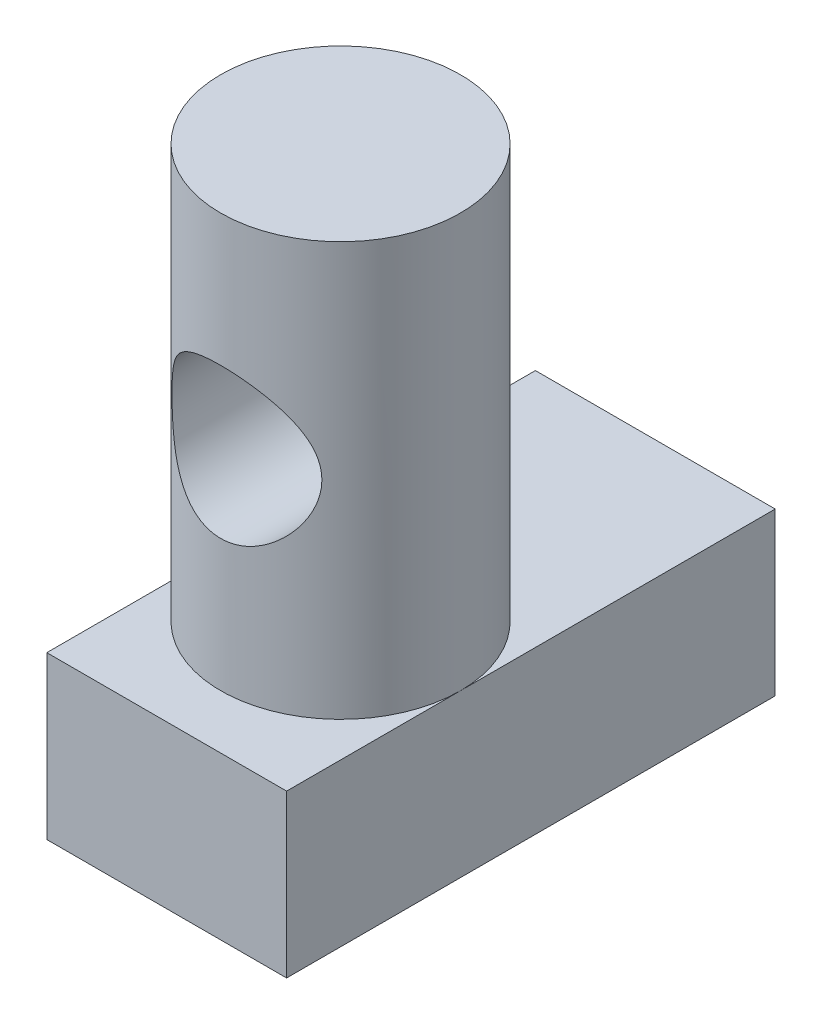
ISO-10303-21;
HEADER;
FILE_DESCRIPTION(('STEP AP214'),'2;1');
FILE_NAME('part.step','',(''),(''),'','','');
FILE_SCHEMA(('AUTOMOTIVE_DESIGN { 1 0 10303 214 1 1 1 1 }'));
ENDSEC;
DATA;
#1=APPLICATION_CONTEXT('core data for automotive mechanical design processes');
#2=APPLICATION_PROTOCOL_DEFINITION('international standard','automotive_design',2000,#1);
#3=PRODUCT_CONTEXT('',#1,'mechanical');
#4=PRODUCT('Part','Part','',(#3));
#5=PRODUCT_RELATED_PRODUCT_CATEGORY('part','',(#4));
#6=PRODUCT_DEFINITION_FORMATION('','',#4);
#7=PRODUCT_DEFINITION_CONTEXT('part definition',#1,'design');
#8=PRODUCT_DEFINITION('design','',#6,#7);
#9=PRODUCT_DEFINITION_SHAPE('','',#8);
#10=(LENGTH_UNIT() NAMED_UNIT(*) SI_UNIT(.MILLI.,.METRE.));
#11=(NAMED_UNIT(*) PLANE_ANGLE_UNIT() SI_UNIT($,.RADIAN.));
#12=(NAMED_UNIT(*) SI_UNIT($,.STERADIAN.) SOLID_ANGLE_UNIT());
#13=UNCERTAINTY_MEASURE_WITH_UNIT(LENGTH_MEASURE(1.E-05),#10,'distance_accuracy_value','');
#14=(GEOMETRIC_REPRESENTATION_CONTEXT(3) GLOBAL_UNCERTAINTY_ASSIGNED_CONTEXT((#13)) GLOBAL_UNIT_ASSIGNED_CONTEXT((#10,
#11,#12)) REPRESENTATION_CONTEXT('',''));
#15=CARTESIAN_POINT('',(0.,0.,0.));
#16=DIRECTION('',(0.,0.,1.));
#17=DIRECTION('',(1.,0.,0.));
#18=AXIS2_PLACEMENT_3D('',#15,#16,#17);
#19=CARTESIAN_POINT('',(0.,0.,0.));
#20=DIRECTION('',(0.,-1.,0.));
#21=DIRECTION('',(0.,0.,-1.));
#22=AXIS2_PLACEMENT_3D('',#19,#20,#21);
#23=PLANE('',#22);
#24=CARTESIAN_POINT('',(0.,0.,1.17500000000001));
#25=DIRECTION('',(0.,1.,0.));
#26=DIRECTION('',(0.,0.,1.));
#27=AXIS2_PLACEMENT_3D('',#24,#25,#26);
#28=CIRCLE('',#27,2.);
#29=CARTESIAN_POINT('',(2.,0.,1.17500000000001));
#30=VERTEX_POINT('',#29);
#31=CARTESIAN_POINT('',(-2.,0.,1.17500000000001));
#32=VERTEX_POINT('',#31);
#33=EDGE_CURVE('E49',#30,#32,#28,.T.);
#34=ORIENTED_EDGE('',*,*,#33,.F.);
#35=DIRECTION('',(0.,0.,-1.));
#36=VECTOR('',#35,1.);
#37=CARTESIAN_POINT('',(2.,0.,-4.07500000000001));
#38=LINE('',#37,#36);
#39=CARTESIAN_POINT('',(2.,0.,-4.07500000000001));
#40=VERTEX_POINT('',#39);
#41=EDGE_CURVE('E100',#30,#40,#38,.T.);
#42=ORIENTED_EDGE('',*,*,#41,.T.);
#43=DIRECTION('',(-1.,0.,0.));
#44=VECTOR('',#43,1.);
#45=CARTESIAN_POINT('',(-2.,0.,-4.075));
#46=LINE('',#45,#44);
#47=CARTESIAN_POINT('',(-2.,0.,-4.075));
#48=VERTEX_POINT('',#47);
#49=EDGE_CURVE('E99',#40,#48,#46,.T.);
#50=ORIENTED_EDGE('',*,*,#49,.T.);
#51=DIRECTION('',(0.,0.,1.));
#52=VECTOR('',#51,1.);
#53=CARTESIAN_POINT('',(-2.,0.,4.07500000000001));
#54=LINE('',#53,#52);
#55=EDGE_CURVE('E111',#48,#32,#54,.T.);
#56=ORIENTED_EDGE('',*,*,#55,.T.);
#57=EDGE_LOOP('',(#34,#42,#50,#56));
#58=FACE_BOUND('',#57,.T.);
#59=ADVANCED_FACE('F34',(#58),#23,.F.);
#60=CARTESIAN_POINT('',(-2.,-2.7,4.07500000000001));
#61=DIRECTION('',(-1.,0.,0.));
#62=DIRECTION('',(0.,0.,1.));
#63=AXIS2_PLACEMENT_3D('',#60,#61,#62);
#64=PLANE('',#63);
#65=ORIENTED_EDGE('',*,*,#55,.F.);
#66=DIRECTION('',(0.,1.,0.));
#67=VECTOR('',#66,1.);
#68=CARTESIAN_POINT('',(-2.,-2.7,-4.075));
#69=LINE('',#68,#67);
#70=CARTESIAN_POINT('',(-2.,-2.7,-4.075));
#71=VERTEX_POINT('',#70);
#72=EDGE_CURVE('E47',#71,#48,#69,.T.);
#73=ORIENTED_EDGE('',*,*,#72,.F.);
#74=DIRECTION('',(0.,0.,1.));
#75=VECTOR('',#74,1.);
#76=CARTESIAN_POINT('',(-2.,-2.7,4.07500000000001));
#77=LINE('',#76,#75);
#78=CARTESIAN_POINT('',(-2.,-2.7,4.07500000000001));
#79=VERTEX_POINT('',#78);
#80=EDGE_CURVE('E153',#71,#79,#77,.T.);
#81=ORIENTED_EDGE('',*,*,#80,.T.);
#82=DIRECTION('',(0.,1.,0.));
#83=VECTOR('',#82,1.);
#84=CARTESIAN_POINT('',(-2.,-2.7,4.07500000000001));
#85=LINE('',#84,#83);
#86=CARTESIAN_POINT('',(-2.,0.,4.07500000000001));
#87=VERTEX_POINT('',#86);
#88=EDGE_CURVE('E88',#79,#87,#85,.T.);
#89=ORIENTED_EDGE('',*,*,#88,.T.);
#90=EDGE_CURVE('E148',#32,#87,#54,.T.);
#91=ORIENTED_EDGE('',*,*,#90,.F.);
#92=EDGE_LOOP('',(#65,#73,#81,#89,#91));
#93=FACE_BOUND('',#92,.T.);
#94=ADVANCED_FACE('F36',(#93),#64,.T.);
#95=CARTESIAN_POINT('',(-2.,-2.7,-4.075));
#96=DIRECTION('',(0.,0.,-1.));
#97=DIRECTION('',(-1.,0.,0.));
#98=AXIS2_PLACEMENT_3D('',#95,#96,#97);
#99=PLANE('',#98);
#100=ORIENTED_EDGE('',*,*,#49,.F.);
#101=DIRECTION('',(0.,1.,0.));
#102=VECTOR('',#101,1.);
#103=CARTESIAN_POINT('',(2.,-2.7,-4.07500000000001));
#104=LINE('',#103,#102);
#105=CARTESIAN_POINT('',(2.,-2.7,-4.07500000000001));
#106=VERTEX_POINT('',#105);
#107=EDGE_CURVE('E106',#106,#40,#104,.T.);
#108=ORIENTED_EDGE('',*,*,#107,.F.);
#109=DIRECTION('',(-1.,0.,0.));
#110=VECTOR('',#109,1.);
#111=CARTESIAN_POINT('',(-2.,-2.7,-4.075));
#112=LINE('',#111,#110);
#113=EDGE_CURVE('E157',#106,#71,#112,.T.);
#114=ORIENTED_EDGE('',*,*,#113,.T.);
#115=ORIENTED_EDGE('',*,*,#72,.T.);
#116=EDGE_LOOP('',(#100,#108,#114,#115));
#117=FACE_BOUND('',#116,.T.);
#118=ADVANCED_FACE('F135',(#117),#99,.T.);
#119=CARTESIAN_POINT('',(2.,-2.7,-4.07500000000001));
#120=DIRECTION('',(1.,0.,0.));
#121=DIRECTION('',(0.,0.,-1.));
#122=AXIS2_PLACEMENT_3D('',#119,#120,#121);
#123=PLANE('',#122);
#124=CARTESIAN_POINT('',(2.,0.,4.07500000000001));
#125=VERTEX_POINT('',#124);
#126=EDGE_CURVE('E94',#125,#30,#38,.T.);
#127=ORIENTED_EDGE('',*,*,#126,.F.);
#128=DIRECTION('',(0.,1.,0.));
#129=VECTOR('',#128,1.);
#130=CARTESIAN_POINT('',(2.,-2.7,4.07500000000001));
#131=LINE('',#130,#129);
#132=CARTESIAN_POINT('',(2.,-2.7,4.07500000000001));
#133=VERTEX_POINT('',#132);
#134=EDGE_CURVE('E146',#133,#125,#131,.T.);
#135=ORIENTED_EDGE('',*,*,#134,.F.);
#136=DIRECTION('',(0.,0.,-1.));
#137=VECTOR('',#136,1.);
#138=CARTESIAN_POINT('',(2.,-2.7,-4.07500000000001));
#139=LINE('',#138,#137);
#140=EDGE_CURVE('E179',#133,#106,#139,.T.);
#141=ORIENTED_EDGE('',*,*,#140,.T.);
#142=ORIENTED_EDGE('',*,*,#107,.T.);
#143=ORIENTED_EDGE('',*,*,#41,.F.);
#144=EDGE_LOOP('',(#127,#135,#141,#142,#143));
#145=FACE_BOUND('',#144,.T.);
#146=ADVANCED_FACE('F104',(#145),#123,.T.);
#147=CARTESIAN_POINT('',(2.,-2.7,4.07500000000001));
#148=DIRECTION('',(0.,0.,1.));
#149=DIRECTION('',(1.,0.,0.));
#150=AXIS2_PLACEMENT_3D('',#147,#148,#149);
#151=PLANE('',#150);
#152=DIRECTION('',(1.,0.,0.));
#153=VECTOR('',#152,1.);
#154=CARTESIAN_POINT('',(2.,0.,4.07500000000001));
#155=LINE('',#154,#153);
#156=EDGE_CURVE('E97',#87,#125,#155,.T.);
#157=ORIENTED_EDGE('',*,*,#156,.F.);
#158=ORIENTED_EDGE('',*,*,#88,.F.);
#159=DIRECTION('',(1.,0.,0.));
#160=VECTOR('',#159,1.);
#161=CARTESIAN_POINT('',(2.,-2.7,4.07500000000001));
#162=LINE('',#161,#160);
#163=EDGE_CURVE('E177',#79,#133,#162,.T.);
#164=ORIENTED_EDGE('',*,*,#163,.T.);
#165=ORIENTED_EDGE('',*,*,#134,.T.);
#166=EDGE_LOOP('',(#157,#158,#164,#165));
#167=FACE_BOUND('',#166,.T.);
#168=ADVANCED_FACE('F140',(#167),#151,.T.);
#169=CARTESIAN_POINT('',(0.,-2.7,0.));
#170=DIRECTION('',(0.,-1.,0.));
#171=DIRECTION('',(0.,0.,-1.));
#172=AXIS2_PLACEMENT_3D('',#169,#170,#171);
#173=PLANE('',#172);
#174=ORIENTED_EDGE('',*,*,#80,.F.);
#175=ORIENTED_EDGE('',*,*,#113,.F.);
#176=ORIENTED_EDGE('',*,*,#140,.F.);
#177=ORIENTED_EDGE('',*,*,#163,.F.);
#178=EDGE_LOOP('',(#174,#175,#176,#177));
#179=FACE_BOUND('',#178,.T.);
#180=ADVANCED_FACE('F125',(#179),#173,.T.);
#181=EDGE_CURVE('E11',#32,#30,#28,.T.);
#182=ORIENTED_EDGE('',*,*,#181,.F.);
#183=ORIENTED_EDGE('',*,*,#90,.T.);
#184=ORIENTED_EDGE('',*,*,#156,.T.);
#185=ORIENTED_EDGE('',*,*,#126,.T.);
#186=EDGE_LOOP('',(#182,#183,#184,#185));
#187=FACE_BOUND('',#186,.T.);
#188=ADVANCED_FACE('F96',(#187),#23,.F.);
#189=CARTESIAN_POINT('',(0.,6.9,1.17500000000001));
#190=DIRECTION('',(0.,-1.,0.));
#191=DIRECTION('',(0.,0.,-1.));
#192=AXIS2_PLACEMENT_3D('',#189,#190,#191);
#193=CYLINDRICAL_SURFACE('',#192,2.);
#194=CARTESIAN_POINT('',(0.,4.7,-0.824999999999993));
#195=CARTESIAN_POINT('',(-0.0635104730002022,4.69999565000122,-0.82499595305312));
#196=CARTESIAN_POINT('',(-0.127096441053757,4.69512698818219,-0.821943233110001));
#197=CARTESIAN_POINT('',(-0.252318262265282,4.6759141965705,-0.810021677241014));
#198=CARTESIAN_POINT('',(-0.313950163299072,4.66155200607452,-0.801141755748952));
#199=CARTESIAN_POINT('',(-0.433205558136782,4.62418863683795,-0.778458529821337));
#200=CARTESIAN_POINT('',(-0.490847243665016,4.60123021215912,-0.764679607786621));
#201=CARTESIAN_POINT('',(-0.60126036886836,4.54761414920325,-0.733345984860724));
#202=CARTESIAN_POINT('',(-0.654032347276152,4.51695736399081,-0.715791702352704));
#203=CARTESIAN_POINT('',(-0.757974192167972,4.44611342681503,-0.676701529022724));
#204=CARTESIAN_POINT('',(-0.808679560769976,4.40536070002455,-0.654959622246163));
#205=CARTESIAN_POINT('',(-0.902986375146758,4.31678082549345,-0.610313499136311));
#206=CARTESIAN_POINT('',(-0.946578107215733,4.26894417174206,-0.587407748585521));
#207=CARTESIAN_POINT('',(-1.03142873237132,4.15996610579548,-0.53930418655198));
#208=CARTESIAN_POINT('',(-1.07157206029151,4.09790021339272,-0.514216109934116));
#209=CARTESIAN_POINT('',(-1.14073966020039,3.96643518455281,-0.468301981287304));
#210=CARTESIAN_POINT('',(-1.16978270899534,3.89704868742392,-0.447468759962378));
#211=CARTESIAN_POINT('',(-1.20933400585981,3.77118947622128,-0.418095756273635));
#212=CARTESIAN_POINT('',(-1.22269552371393,3.71603318146118,-0.407769059900731));
#213=CARTESIAN_POINT('',(-1.2418184358548,3.6036940743892,-0.392813573258048));
#214=CARTESIAN_POINT('',(-1.24759056342088,3.54651424172551,-0.388176736736916));
#215=CARTESIAN_POINT('',(-1.2511891824572,3.43158698324888,-0.385298857828265));
#216=CARTESIAN_POINT('',(-1.24899483727851,3.3738384635376,-0.387074587717179));
#217=CARTESIAN_POINT('',(-1.23676317046804,3.25968989681104,-0.396774023839191));
#218=CARTESIAN_POINT('',(-1.22671956265043,3.20329096796092,-0.404702657671095));
#219=CARTESIAN_POINT('',(-1.19968103371474,3.09456154734252,-0.4253257312178));
#220=CARTESIAN_POINT('',(-1.18285016736897,3.04216754431573,-0.437907151048131));
#221=CARTESIAN_POINT('',(-1.14290189820937,2.94083881759458,-0.46645566443405));
#222=CARTESIAN_POINT('',(-1.11978227193696,2.89190532512551,-0.482423955013528));
#223=CARTESIAN_POINT('',(-1.06294892954949,2.78916672616726,-0.51954815993019));
#224=CARTESIAN_POINT('',(-1.0280629660117,2.73615918987961,-0.541115915759584));
#225=CARTESIAN_POINT('',(-0.950881463002101,2.63616972099952,-0.585057117912427));
#226=CARTESIAN_POINT('',(-0.908578308011437,2.58919406829348,-0.607431373359749));
#227=CARTESIAN_POINT('',(-0.809519713023332,2.49469825062961,-0.654798949168561));
#228=CARTESIAN_POINT('',(-0.751531353595333,2.44836702574117,-0.679615316765924));
#229=CARTESIAN_POINT('',(-0.627148099593569,2.36614910411275,-0.725280550624441));
#230=CARTESIAN_POINT('',(-0.560756523881999,2.33025830227107,-0.746130975147631));
#231=CARTESIAN_POINT('',(-0.424883562934748,2.27223631161858,-0.780533729613156));
#232=CARTESIAN_POINT('',(-0.355763457732371,2.24946596001882,-0.794419765915734));
#233=CARTESIAN_POINT('',(-0.213612154574976,2.21623507201719,-0.814849293100475));
#234=CARTESIAN_POINT('',(-0.140586648341304,2.205757105778,-0.821403179900693));
#235=CARTESIAN_POINT('',(-0.00451561874058841,2.1984341499388,-0.825978405400905));
#236=CARTESIAN_POINT('',(0.058402774163785,2.19979682204614,-0.825121613455099));
#237=CARTESIAN_POINT('',(0.182972117996309,2.21188282842072,-0.817589014943261));
#238=CARTESIAN_POINT('',(0.244623154962733,2.22260552509216,-0.810913604735907));
#239=CARTESIAN_POINT('',(0.36252107065819,2.25223853669196,-0.79274052283069));
#240=CARTESIAN_POINT('',(0.418885009953204,2.27081215679665,-0.781441705268432));
#241=CARTESIAN_POINT('',(0.527638281070988,2.31529638927857,-0.754956841047508));
#242=CARTESIAN_POINT('',(0.580026945470715,2.34120823025515,-0.739770143502657));
#243=CARTESIAN_POINT('',(0.685084056277257,2.40251520599548,-0.704900123559997));
#244=CARTESIAN_POINT('',(0.737246967843405,2.43860356923824,-0.684917648172239));
#245=CARTESIAN_POINT('',(0.835142640217341,2.51779386515281,-0.643069700017161));
#246=CARTESIAN_POINT('',(0.880868151291855,2.56090358925454,-0.621202148263834));
#247=CARTESIAN_POINT('',(0.971474198022883,2.66013503941265,-0.574058697130906));
#248=CARTESIAN_POINT('',(1.01526851939752,2.71723720629478,-0.548748834149564));
#249=CARTESIAN_POINT('',(1.09280351885684,2.83887578494425,-0.500667627481714));
#250=CARTESIAN_POINT('',(1.12655115718694,2.90340700675299,-0.477894533223356));
#251=CARTESIAN_POINT('',(1.17684772011828,3.02469214805688,-0.442335303145913));
#252=CARTESIAN_POINT('',(1.1955189586548,3.08024075073222,-0.42845636193779));
#253=CARTESIAN_POINT('',(1.22500108205245,3.19439314576892,-0.406050306637665));
#254=CARTESIAN_POINT('',(1.23582424983127,3.25299200945146,-0.397514832426048));
#255=CARTESIAN_POINT('',(1.24901383653654,3.37209027688069,-0.387063249887308));
#256=CARTESIAN_POINT('',(1.25133186963293,3.43259858548817,-0.38518501674568));
#257=CARTESIAN_POINT('',(1.24719778716818,3.55313096036604,-0.388490631098465));
#258=CARTESIAN_POINT('',(1.24074275650143,3.61315485900951,-0.393676825955851));
#259=CARTESIAN_POINT('',(1.220382724034,3.72602979505136,-0.409553887713333));
#260=CARTESIAN_POINT('',(1.2071191949977,3.77906930141641,-0.419768080510594));
#261=CARTESIAN_POINT('',(1.17417623469513,3.88213505958591,-0.444175304356895));
#262=CARTESIAN_POINT('',(1.15449412799407,3.9321600445375,-0.458369994237267));
#263=CARTESIAN_POINT('',(1.10602690439618,4.0355967438727,-0.491639028865174));
#264=CARTESIAN_POINT('',(1.0763364445546,4.08845029847655,-0.511122304989962));
#265=CARTESIAN_POINT('',(1.0100001703639,4.18893836724601,-0.551677064118672));
#266=CARTESIAN_POINT('',(0.973348732866944,4.23656861256048,-0.572749822768245));
#267=CARTESIAN_POINT('',(0.885670221416064,4.33501425497784,-0.619019107311807));
#268=CARTESIAN_POINT('',(0.833233674246799,4.38459084544548,-0.644205418087755));
#269=CARTESIAN_POINT('',(0.719822446025209,4.47449482970524,-0.691987290567472));
#270=CARTESIAN_POINT('',(0.658842515138554,4.5148164959274,-0.714581243643939));
#271=CARTESIAN_POINT('',(0.529355399891413,4.5847711301241,-0.754867109765475));
#272=CARTESIAN_POINT('',(0.460835727056575,4.61438600540584,-0.772550713553556));
#273=CARTESIAN_POINT('',(0.318394712729504,4.66107188433175,-0.800815216378417));
#274=CARTESIAN_POINT('',(0.244493501106855,4.67818723486978,-0.811421214286884));
#275=CARTESIAN_POINT('',(0.141418481224667,4.69229920916263,-0.820194721681424));
#276=CARTESIAN_POINT('',(0.113248608862872,4.69518186533397,-0.821991722263006));
#277=CARTESIAN_POINT('',(0.0567241864870911,4.6990332915376,-0.824395302132389));
#278=CARTESIAN_POINT('',(0.0283696251514536,4.70000194310999,-0.825001807739101));
#279=CARTESIAN_POINT('',(0.,4.7,-0.824999999999993));
#280=B_SPLINE_CURVE_WITH_KNOTS('',3,(#194,#195,#196,#197,#198,#199,#200,#201,#202,#203,#204,
#205,#206,#207,#208,#209,#210,#211,#212,#213,#214,#215,#216,#217,#218,#219,#220,#221,#222,#223,
#224,#225,#226,#227,#228,#229,#230,#231,#232,#233,#234,#235,#236,#237,#238,#239,#240,#241,#242,
#243,#244,#245,#246,#247,#248,#249,#250,#251,#252,#253,#254,#255,#256,#257,#258,#259,#260,#261,
#262,#263,#264,#265,#266,#267,#268,#269,#270,#271,#272,#273,#274,#275,#276,#277,#278,#279),
.UNSPECIFIED.,.T.,.F.,(4,2,2,2,2,2,2,2,2,2,2,2,2,2,2,2,2,2,2,2,2,2,2,2,2,2,2,2,2,2,2,2,2,2,2,2,
2,2,2,2,2,2,4),(0.,0.190412301434133,0.381187894128462,0.571026987595136,0.760845054038795,
0.965821870536217,1.17107628325702,1.40412975852973,1.6367872460701,1.80912008879717,
1.98120894707391,2.15374823498778,2.32642584505083,2.49515839460437,2.66395067908033,
2.8642745035436,3.06480522575182,3.29842180699522,3.53194640727861,3.75284174135959,
3.97342347958131,4.16127180597573,4.34910733732281,4.52959504531298,4.71011298928467,
4.90885230990553,5.10781368827686,5.33565708863713,5.56334227196911,5.7432994031372,
5.92297427413352,6.10366974688201,6.28442527563864,6.45063169037741,6.61690747313442,
6.80725523036979,6.9977574115377,7.22600539035112,7.454394245785,7.68316725607078,
7.91112460944408,7.99617501232481,8.08123067890589),.UNSPECIFIED.);
#281=CARTESIAN_POINT('',(0.,4.7,-0.824999999999993));
#282=VERTEX_POINT('',#281);
#283=EDGE_CURVE('E38',#282,#282,#280,.T.);
#284=ORIENTED_EDGE('',*,*,#283,.T.);
#285=EDGE_LOOP('',(#284));
#286=FACE_BOUND('',#285,.T.);
#287=CARTESIAN_POINT('',(1.25,3.45,2.73624949959961));
#288=CARTESIAN_POINT('',(1.24999462210485,3.38787971819707,2.73625800072559));
#289=CARTESIAN_POINT('',(1.24532693849666,3.32566216462974,2.74002642708837));
#290=CARTESIAN_POINT('',(1.22698950832934,3.20332367992062,2.75443717205479));
#291=CARTESIAN_POINT('',(1.21329530430551,3.14320891363476,2.76509816464116));
#292=CARTESIAN_POINT('',(1.17788073911871,3.02721767730116,2.79150085329042));
#293=CARTESIAN_POINT('',(1.15622993332784,2.97130939131819,2.80719837418034));
#294=CARTESIAN_POINT('',(1.10571945561924,2.86399113836185,2.84182950714433));
#295=CARTESIAN_POINT('',(1.07685958706091,2.8125812941435,2.86076320748677));
#296=CARTESIAN_POINT('',(1.00823937928364,2.70813484552302,2.90279611374712));
#297=CARTESIAN_POINT('',(0.967536093692503,2.65580525916741,2.92611338227347));
#298=CARTESIAN_POINT('',(0.87830866449688,2.55811730085503,2.97252820854877));
#299=CARTESIAN_POINT('',(0.829777781297414,2.51276500271608,2.9956255586333));
#300=CARTESIAN_POINT('',(0.719186665258491,2.42489641485188,3.0422945389101));
#301=CARTESIAN_POINT('',(0.656200568910556,2.3833823318957,3.06558722241451));
#302=CARTESIAN_POINT('',(0.522404070837316,2.31187479523684,3.10683231699141));
#303=CARTESIAN_POINT('',(0.451601506478242,2.28186993424875,3.12479001179838));
#304=CARTESIAN_POINT('',(0.311776878362019,2.23751768939294,3.15169841318201));
#305=CARTESIAN_POINT('',(0.243305636047241,2.22188858360306,3.16137922422039));
#306=CARTESIAN_POINT('',(0.104105100662264,2.2023679303566,3.17350544379203));
#307=CARTESIAN_POINT('',(0.0333782605640272,2.19846404387945,3.17595845843657));
#308=CARTESIAN_POINT('',(-0.09806582842134,2.20235568927761,3.17352909107528));
#309=CARTESIAN_POINT('',(-0.158852523273786,2.2086513763009,3.16958699811903));
#310=CARTESIAN_POINT('',(-0.278306645903669,2.22986698436332,3.15645272261226));
#311=CARTESIAN_POINT('',(-0.336973913146974,2.24478755723752,3.14726014325118));
#312=CARTESIAN_POINT('',(-0.450889117077072,2.28260377509712,3.12438133614676));
#313=CARTESIAN_POINT('',(-0.506127875493232,2.30551982404859,3.11068361673913));
#314=CARTESIAN_POINT('',(-0.612019220469382,2.35846875525999,3.07985632889332));
#315=CARTESIAN_POINT('',(-0.662670758560001,2.3885032588906,3.06272597874227));
#316=CARTESIAN_POINT('',(-0.764713515567041,2.45902816532937,3.02393224750794));
#317=CARTESIAN_POINT('',(-0.815412344918949,2.50035462674233,3.00197004307145));
#318=CARTESIAN_POINT('',(-0.909598595905498,2.59013238022337,2.95695462752238));
#319=CARTESIAN_POINT('',(-0.953075338789632,2.63859402644655,2.93389986449172));
#320=CARTESIAN_POINT('',(-1.03735445892932,2.74870562290611,2.88571442112196));
#321=CARTESIAN_POINT('',(-1.07706615479946,2.8112513808503,2.86070581533195));
#322=CARTESIAN_POINT('',(-1.14526153203309,2.94364611977343,2.815141390954));
#323=CARTESIAN_POINT('',(-1.17376589603358,3.01348134395541,2.7945774019168));
#324=CARTESIAN_POINT('',(-1.21218566853166,3.13976940288788,2.76591876567121));
#325=CARTESIAN_POINT('',(-1.22501841721721,3.19491096263767,2.75596704305273));
#326=CARTESIAN_POINT('',(-1.24310168537523,3.30711518874893,2.74179138875766));
#327=CARTESIAN_POINT('',(-1.24836256353275,3.3641751210399,2.73755963237429));
#328=CARTESIAN_POINT('',(-1.25098535954508,3.47872868054027,2.73546133530165));
#329=CARTESIAN_POINT('',(-1.24832917576576,3.53622300136582,2.73760938140436));
#330=CARTESIAN_POINT('',(-1.23525733555987,3.6497805810316,2.74796042862705));
#331=CARTESIAN_POINT('',(-1.22483525320262,3.70584261496292,2.75616844404657));
#332=CARTESIAN_POINT('',(-1.1970493572483,3.81421838386581,2.77730060601958));
#333=CARTESIAN_POINT('',(-1.17980280626788,3.86657867333151,2.79014477937172));
#334=CARTESIAN_POINT('',(-1.13902451938523,3.96778733455698,2.81915573440842));
#335=CARTESIAN_POINT('',(-1.11549055271421,4.0166344520245,2.83532369489909));
#336=CARTESIAN_POINT('',(-1.05765376772319,4.11930603917703,2.87287203988938));
#337=CARTESIAN_POINT('',(-1.02215373814221,4.17230754124933,2.8946587573829));
#338=CARTESIAN_POINT('',(-0.943690263224861,4.27218505243915,2.93893958000712));
#339=CARTESIAN_POINT('',(-0.900719074496599,4.31905461697796,2.96143439903355));
#340=CARTESIAN_POINT('',(-0.800380659499192,4.41298324624316,3.00883164018973));
#341=CARTESIAN_POINT('',(-0.741809949714161,4.45886855700768,3.03354204787598));
#342=CARTESIAN_POINT('',(-0.616299987869575,4.54006865187586,3.07884248965));
#343=CARTESIAN_POINT('',(-0.54936467874866,4.57538838997364,3.09943445329133));
#344=CARTESIAN_POINT('',(-0.412925900636597,4.63199499120264,3.13309255957562));
#345=CARTESIAN_POINT('',(-0.343814822544517,4.65399420647076,3.14653484589181));
#346=CARTESIAN_POINT('',(-0.201860998884744,4.68572666868109,3.1660701008804));
#347=CARTESIAN_POINT('',(-0.129023563238364,4.69547688976111,3.17217323933004));
#348=CARTESIAN_POINT('',(0.00659907199681507,4.70154652003878,3.17596685748559));
#349=CARTESIAN_POINT('',(0.0692812975954768,4.69963577678698,3.17476600623617));
#350=CARTESIAN_POINT('',(0.193279811091728,4.68653832502566,3.16660739958773));
#351=CARTESIAN_POINT('',(0.254596160840745,4.67535203742423,3.15964990541519));
#352=CARTESIAN_POINT('',(0.372043294685528,4.64483952512341,3.1409610468898));
#353=CARTESIAN_POINT('',(0.428280180678311,4.6258091601268,3.12940367471702));
#354=CARTESIAN_POINT('',(0.536714369111317,4.58044007183593,3.10244968677265));
#355=CARTESIAN_POINT('',(0.588910988118242,4.55410011552441,3.08705242331406));
#356=CARTESIAN_POINT('',(0.693656737470668,4.4918394210088,3.05175342239825));
#357=CARTESIAN_POINT('',(0.745680127162213,4.45520801868102,3.03155002466956));
#358=CARTESIAN_POINT('',(0.843216608355416,4.3749233696673,2.98933640456238));
#359=CARTESIAN_POINT('',(0.888722243055232,4.33126219975406,2.96732415730621));
#360=CARTESIAN_POINT('',(0.978723601300807,4.23088373769673,2.92000415099525));
#361=CARTESIAN_POINT('',(1.02212829873816,4.17319165482308,2.89467871446314));
#362=CARTESIAN_POINT('',(1.09877325005744,4.05035533398988,2.84674821497037));
#363=CARTESIAN_POINT('',(1.132019125571,3.9852152450924,2.82414165167052));
#364=CARTESIAN_POINT('',(1.18099110923231,3.86359723207033,2.78929776080214));
#365=CARTESIAN_POINT('',(1.19896216276381,3.80836431912064,2.77587340349653));
#366=CARTESIAN_POINT('',(1.22712822180408,3.69503072204281,2.7543915843794));
#367=CARTESIAN_POINT('',(1.23734784245405,3.63693974497586,2.74631714400176));
#368=CARTESIAN_POINT('',(1.24559906183097,3.55696947613715,2.73976456389395));
#369=CARTESIAN_POINT('',(1.24724671259581,3.53563585448301,2.73845069546827));
#370=CARTESIAN_POINT('',(1.24944824734288,3.49287203347851,2.73669158695047));
#371=CARTESIAN_POINT('',(1.25000185626673,3.47144181119832,2.73624656529968));
#372=CARTESIAN_POINT('',(1.25,3.45,2.73624949959961));
#373=B_SPLINE_CURVE_WITH_KNOTS('',3,(#287,#288,#289,#290,#291,#292,#293,#294,#295,#296,#297,
#298,#299,#300,#301,#302,#303,#304,#305,#306,#307,#308,#309,#310,#311,#312,#313,#314,#315,#316,
#317,#318,#319,#320,#321,#322,#323,#324,#325,#326,#327,#328,#329,#330,#331,#332,#333,#334,#335,
#336,#337,#338,#339,#340,#341,#342,#343,#344,#345,#346,#347,#348,#349,#350,#351,#352,#353,#354,
#355,#356,#357,#358,#359,#360,#361,#362,#363,#364,#365,#366,#367,#368,#369,#370,#371,#372),
.UNSPECIFIED.,.T.,.F.,(4,2,2,2,2,2,2,2,2,2,2,2,2,2,2,2,2,2,2,2,2,2,2,2,2,2,2,2,2,2,2,2,2,2,2,2,
2,2,2,2,2,2,4),(0.,0.186262444012015,0.373031654397096,0.558205556130402,0.743384509377751,
0.953406207440073,1.16360970997911,1.39917236034457,1.6345009273926,1.84590412815398,
2.05708478092387,2.23992319583511,2.42277543076414,2.60609774825956,2.78946186128171,
2.99564504832107,3.20213044016186,3.43558067920821,3.66859805095278,3.84032775480268,
4.01182230007289,4.18370925240739,4.35573859160081,4.52493212343598,4.69418576487135,
4.89566333610129,5.09735098485254,5.33136598660889,5.56527109061626,5.78520080494549,
6.00482541258961,6.19203601525124,6.37923812308583,6.55994569114424,6.74068376037881,
6.94018144108746,7.13990556958868,7.36841817421249,7.59680409585386,7.77496902270413,
7.95256577963385,8.01684109069498,8.08113255947023),.UNSPECIFIED.);
#374=CARTESIAN_POINT('',(1.25,3.45,2.73624949959961));
#375=VERTEX_POINT('',#374);
#376=EDGE_CURVE('E158',#375,#375,#373,.T.);
#377=ORIENTED_EDGE('',*,*,#376,.T.);
#378=EDGE_LOOP('',(#377));
#379=FACE_BOUND('',#378,.T.);
#380=CARTESIAN_POINT('',(0.,6.9,1.17500000000001));
#381=DIRECTION('',(0.,1.,0.));
#382=DIRECTION('',(0.,0.,1.));
#383=AXIS2_PLACEMENT_3D('',#380,#381,#382);
#384=CIRCLE('',#383,2.);
#385=CARTESIAN_POINT('',(0.,6.9,3.17500000000001));
#386=VERTEX_POINT('',#385);
#387=EDGE_CURVE('E113',#386,#386,#384,.T.);
#388=ORIENTED_EDGE('',*,*,#387,.F.);
#389=EDGE_LOOP('',(#388));
#390=FACE_BOUND('',#389,.T.);
#391=ORIENTED_EDGE('',*,*,#33,.T.);
#392=ORIENTED_EDGE('',*,*,#181,.T.);
#393=EDGE_LOOP('',(#391,#392));
#394=FACE_BOUND('',#393,.T.);
#395=ADVANCED_FACE('F114',(#286,#379,#390,#394),#193,.T.);
#396=CARTESIAN_POINT('',(0.,6.9,1.17500000000001));
#397=DIRECTION('',(0.,1.,0.));
#398=DIRECTION('',(0.,0.,1.));
#399=AXIS2_PLACEMENT_3D('',#396,#397,#398);
#400=PLANE('',#399);
#401=ORIENTED_EDGE('',*,*,#387,.T.);
#402=EDGE_LOOP('',(#401));
#403=FACE_BOUND('',#402,.T.);
#404=ADVANCED_FACE('F116',(#403),#400,.T.);
#405=CARTESIAN_POINT('',(0.,3.45,-9.42499999999999));
#406=DIRECTION('',(0.,0.,1.));
#407=DIRECTION('',(1.,0.,0.));
#408=AXIS2_PLACEMENT_3D('',#405,#406,#407);
#409=CYLINDRICAL_SURFACE('',#408,1.25);
#410=ORIENTED_EDGE('',*,*,#376,.F.);
#411=EDGE_LOOP('',(#410));
#412=FACE_BOUND('',#411,.T.);
#413=ORIENTED_EDGE('',*,*,#283,.F.);
#414=EDGE_LOOP('',(#413));
#415=FACE_BOUND('',#414,.T.);
#416=ADVANCED_FACE('F122',(#412,#415),#409,.F.);
#417=CLOSED_SHELL('',(#59,#94,#118,#146,#168,#180,#188,#395,#404,#416));
#418=MANIFOLD_SOLID_BREP('B2',#417);
#419=ADVANCED_BREP_SHAPE_REPRESENTATION('',(#18,#418),#14);
#420=SHAPE_DEFINITION_REPRESENTATION(#9,#419);
ENDSEC;
END-ISO-10303-21;
